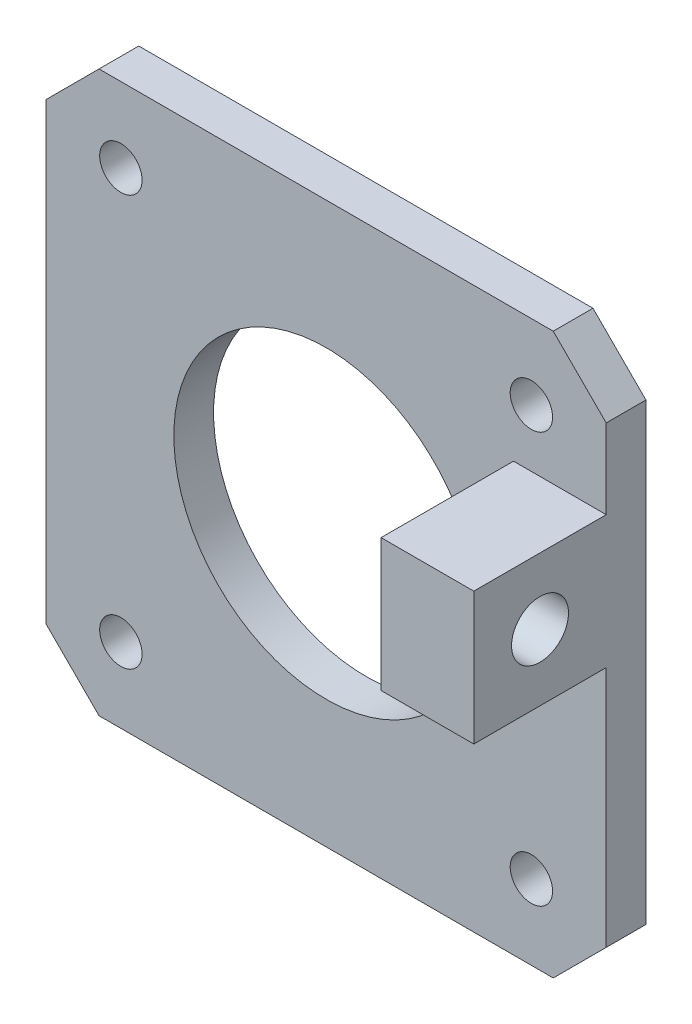
ISO-10303-21;
HEADER;
FILE_DESCRIPTION(('STEP AP214'),'2;1');
FILE_NAME('part.step','',(''),(''),'','','');
FILE_SCHEMA(('AUTOMOTIVE_DESIGN { 1 0 10303 214 1 1 1 1 }'));
ENDSEC;
DATA;
#1=APPLICATION_CONTEXT('core data for automotive mechanical design processes');
#2=APPLICATION_PROTOCOL_DEFINITION('international standard','automotive_design',2000,#1);
#3=PRODUCT_CONTEXT('',#1,'mechanical');
#4=PRODUCT('Part','Part','',(#3));
#5=PRODUCT_RELATED_PRODUCT_CATEGORY('part','',(#4));
#6=PRODUCT_DEFINITION_FORMATION('','',#4);
#7=PRODUCT_DEFINITION_CONTEXT('part definition',#1,'design');
#8=PRODUCT_DEFINITION('design','',#6,#7);
#9=PRODUCT_DEFINITION_SHAPE('','',#8);
#10=(LENGTH_UNIT() NAMED_UNIT(*) SI_UNIT(.MILLI.,.METRE.));
#11=(NAMED_UNIT(*) PLANE_ANGLE_UNIT() SI_UNIT($,.RADIAN.));
#12=(NAMED_UNIT(*) SI_UNIT($,.STERADIAN.) SOLID_ANGLE_UNIT());
#13=UNCERTAINTY_MEASURE_WITH_UNIT(LENGTH_MEASURE(1.E-05),#10,'distance_accuracy_value','');
#14=(GEOMETRIC_REPRESENTATION_CONTEXT(3) GLOBAL_UNCERTAINTY_ASSIGNED_CONTEXT((#13)) GLOBAL_UNIT_ASSIGNED_CONTEXT((#10,
#11,#12)) REPRESENTATION_CONTEXT('',''));
#15=CARTESIAN_POINT('',(0.,0.,0.));
#16=DIRECTION('',(0.,0.,1.));
#17=DIRECTION('',(1.,0.,0.));
#18=AXIS2_PLACEMENT_3D('',#15,#16,#17);
#19=CARTESIAN_POINT('',(0.,0.,3.));
#20=DIRECTION('',(0.,0.,-1.));
#21=DIRECTION('',(-1.,0.,0.));
#22=AXIS2_PLACEMENT_3D('',#19,#20,#21);
#23=PLANE('',#22);
#24=CARTESIAN_POINT('',(15.5,-15.5,3.));
#25=DIRECTION('',(0.,0.,1.));
#26=DIRECTION('',(1.,0.,0.));
#27=AXIS2_PLACEMENT_3D('',#24,#25,#26);
#28=CIRCLE('',#27,1.6);
#29=CARTESIAN_POINT('',(17.1,-15.5,3.));
#30=VERTEX_POINT('',#29);
#31=EDGE_CURVE('E234',#30,#30,#28,.T.);
#32=ORIENTED_EDGE('',*,*,#31,.F.);
#33=EDGE_LOOP('',(#32));
#34=FACE_BOUND('',#33,.T.);
#35=CARTESIAN_POINT('',(-15.5,15.5,3.));
#36=DIRECTION('',(0.,0.,1.));
#37=DIRECTION('',(1.,0.,0.));
#38=AXIS2_PLACEMENT_3D('',#35,#36,#37);
#39=CIRCLE('',#38,1.60000000000001);
#40=CARTESIAN_POINT('',(-13.9,15.5,3.));
#41=VERTEX_POINT('',#40);
#42=EDGE_CURVE('E228',#41,#41,#39,.T.);
#43=ORIENTED_EDGE('',*,*,#42,.F.);
#44=EDGE_LOOP('',(#43));
#45=FACE_BOUND('',#44,.T.);
#46=CARTESIAN_POINT('',(-15.5,-15.5,3.));
#47=DIRECTION('',(0.,0.,1.));
#48=DIRECTION('',(1.,0.,0.));
#49=AXIS2_PLACEMENT_3D('',#46,#47,#48);
#50=CIRCLE('',#49,1.6);
#51=CARTESIAN_POINT('',(-13.9,-15.5,3.));
#52=VERTEX_POINT('',#51);
#53=EDGE_CURVE('E222',#52,#52,#50,.T.);
#54=ORIENTED_EDGE('',*,*,#53,.F.);
#55=EDGE_LOOP('',(#54));
#56=FACE_BOUND('',#55,.T.);
#57=CARTESIAN_POINT('',(15.5,15.5,3.));
#58=DIRECTION('',(0.,0.,1.));
#59=DIRECTION('',(1.,0.,0.));
#60=AXIS2_PLACEMENT_3D('',#57,#58,#59);
#61=CIRCLE('',#60,1.60000000000001);
#62=CARTESIAN_POINT('',(17.1,15.5,3.));
#63=VERTEX_POINT('',#62);
#64=EDGE_CURVE('E216',#63,#63,#61,.T.);
#65=ORIENTED_EDGE('',*,*,#64,.F.);
#66=EDGE_LOOP('',(#65));
#67=FACE_BOUND('',#66,.T.);
#68=CARTESIAN_POINT('',(0.,0.,3.));
#69=DIRECTION('',(0.,0.,1.));
#70=DIRECTION('',(1.,0.,0.));
#71=AXIS2_PLACEMENT_3D('',#68,#69,#70);
#72=CIRCLE('',#71,11.5);
#73=CARTESIAN_POINT('',(11.5,0.,3.));
#74=VERTEX_POINT('',#73);
#75=EDGE_CURVE('E167',#74,#74,#72,.T.);
#76=ORIENTED_EDGE('',*,*,#75,.F.);
#77=EDGE_LOOP('',(#76));
#78=FACE_BOUND('',#77,.T.);
#79=DIRECTION('',(1.,0.,0.));
#80=VECTOR('',#79,1.);
#81=CARTESIAN_POINT('',(14.15,1.15000000011601,3.));
#82=LINE('',#81,#80);
#83=CARTESIAN_POINT('',(14.15,1.15000000011601,3.));
#84=VERTEX_POINT('',#83);
#85=CARTESIAN_POINT('',(21.15,1.15000000011601,3.));
#86=VERTEX_POINT('',#85);
#87=EDGE_CURVE('E246',#84,#86,#82,.T.);
#88=ORIENTED_EDGE('',*,*,#87,.F.);
#89=DIRECTION('',(0.,-1.,0.));
#90=VECTOR('',#89,1.);
#91=CARTESIAN_POINT('',(14.15,0.,3.));
#92=LINE('',#91,#90);
#93=CARTESIAN_POINT('',(14.15,11.150000000116,3.));
#94=VERTEX_POINT('',#93);
#95=EDGE_CURVE('E263',#94,#84,#92,.T.);
#96=ORIENTED_EDGE('',*,*,#95,.F.);
#97=DIRECTION('',(1.,0.,0.));
#98=VECTOR('',#97,1.);
#99=CARTESIAN_POINT('',(14.15,11.150000000116,3.));
#100=LINE('',#99,#98);
#101=CARTESIAN_POINT('',(21.15,11.150000000116,3.));
#102=VERTEX_POINT('',#101);
#103=EDGE_CURVE('E250',#94,#102,#100,.T.);
#104=ORIENTED_EDGE('',*,*,#103,.T.);
#105=DIRECTION('',(0.,1.,0.));
#106=VECTOR('',#105,1.);
#107=CARTESIAN_POINT('',(21.15,17.15,3.));
#108=LINE('',#107,#106);
#109=CARTESIAN_POINT('',(21.15,17.15,3.));
#110=VERTEX_POINT('',#109);
#111=EDGE_CURVE('E140',#102,#110,#108,.T.);
#112=ORIENTED_EDGE('',*,*,#111,.T.);
#113=DIRECTION('',(-0.707106781186548,0.707106781186548,0.));
#114=VECTOR('',#113,1.);
#115=CARTESIAN_POINT('',(21.15,17.15,3.));
#116=LINE('',#115,#114);
#117=CARTESIAN_POINT('',(17.15,21.15,3.));
#118=VERTEX_POINT('',#117);
#119=EDGE_CURVE('E71',#110,#118,#116,.T.);
#120=ORIENTED_EDGE('',*,*,#119,.T.);
#121=DIRECTION('',(-1.,0.,0.));
#122=VECTOR('',#121,1.);
#123=CARTESIAN_POINT('',(-17.15,21.15,3.));
#124=LINE('',#123,#122);
#125=CARTESIAN_POINT('',(-17.15,21.15,3.));
#126=VERTEX_POINT('',#125);
#127=EDGE_CURVE('E179',#118,#126,#124,.T.);
#128=ORIENTED_EDGE('',*,*,#127,.T.);
#129=DIRECTION('',(-0.707106781186548,-0.707106781186548,0.));
#130=VECTOR('',#129,1.);
#131=CARTESIAN_POINT('',(-21.15,17.15,3.));
#132=LINE('',#131,#130);
#133=CARTESIAN_POINT('',(-21.15,17.15,3.));
#134=VERTEX_POINT('',#133);
#135=EDGE_CURVE('E112',#126,#134,#132,.T.);
#136=ORIENTED_EDGE('',*,*,#135,.T.);
#137=DIRECTION('',(0.,-1.,0.));
#138=VECTOR('',#137,1.);
#139=CARTESIAN_POINT('',(-21.15,-17.15,3.));
#140=LINE('',#139,#138);
#141=CARTESIAN_POINT('',(-21.15,-17.15,3.));
#142=VERTEX_POINT('',#141);
#143=EDGE_CURVE('E194',#134,#142,#140,.T.);
#144=ORIENTED_EDGE('',*,*,#143,.T.);
#145=DIRECTION('',(0.707106781186548,-0.707106781186548,0.));
#146=VECTOR('',#145,1.);
#147=CARTESIAN_POINT('',(-17.15,-21.15,3.));
#148=LINE('',#147,#146);
#149=CARTESIAN_POINT('',(-17.15,-21.15,3.));
#150=VERTEX_POINT('',#149);
#151=EDGE_CURVE('E207',#142,#150,#148,.T.);
#152=ORIENTED_EDGE('',*,*,#151,.T.);
#153=DIRECTION('',(1.,0.,0.));
#154=VECTOR('',#153,1.);
#155=CARTESIAN_POINT('',(17.15,-21.15,3.));
#156=LINE('',#155,#154);
#157=CARTESIAN_POINT('',(17.15,-21.15,3.));
#158=VERTEX_POINT('',#157);
#159=EDGE_CURVE('E136',#150,#158,#156,.T.);
#160=ORIENTED_EDGE('',*,*,#159,.T.);
#161=DIRECTION('',(0.707106781186548,0.707106781186548,0.));
#162=VECTOR('',#161,1.);
#163=CARTESIAN_POINT('',(21.15,-17.15,3.));
#164=LINE('',#163,#162);
#165=CARTESIAN_POINT('',(21.15,-17.15,3.));
#166=VERTEX_POINT('',#165);
#167=EDGE_CURVE('E129',#158,#166,#164,.T.);
#168=ORIENTED_EDGE('',*,*,#167,.T.);
#169=EDGE_CURVE('E134',#166,#86,#108,.T.);
#170=ORIENTED_EDGE('',*,*,#169,.T.);
#171=EDGE_LOOP('',(#88,#96,#104,#112,#120,#128,#136,#144,#152,#160,#168,#170));
#172=FACE_BOUND('',#171,.T.);
#173=ADVANCED_FACE('F47',(#34,#45,#56,#67,#78,#172),#23,.F.);
#174=CARTESIAN_POINT('',(0.,0.,0.));
#175=DIRECTION('',(0.,0.,-1.));
#176=DIRECTION('',(-1.,0.,0.));
#177=AXIS2_PLACEMENT_3D('',#174,#175,#176);
#178=PLANE('',#177);
#179=CARTESIAN_POINT('',(-15.5,15.5,0.));
#180=DIRECTION('',(0.,0.,1.));
#181=DIRECTION('',(1.,0.,0.));
#182=AXIS2_PLACEMENT_3D('',#179,#180,#181);
#183=CIRCLE('',#182,1.60000000000001);
#184=CARTESIAN_POINT('',(-13.9,15.5,0.));
#185=VERTEX_POINT('',#184);
#186=EDGE_CURVE('E231',#185,#185,#183,.T.);
#187=ORIENTED_EDGE('',*,*,#186,.T.);
#188=EDGE_LOOP('',(#187));
#189=FACE_BOUND('',#188,.T.);
#190=CARTESIAN_POINT('',(15.5,15.5,0.));
#191=DIRECTION('',(0.,0.,1.));
#192=DIRECTION('',(1.,0.,0.));
#193=AXIS2_PLACEMENT_3D('',#190,#191,#192);
#194=CIRCLE('',#193,1.60000000000001);
#195=CARTESIAN_POINT('',(17.1,15.5,0.));
#196=VERTEX_POINT('',#195);
#197=EDGE_CURVE('E219',#196,#196,#194,.T.);
#198=ORIENTED_EDGE('',*,*,#197,.T.);
#199=EDGE_LOOP('',(#198));
#200=FACE_BOUND('',#199,.T.);
#201=DIRECTION('',(-1.,0.,0.));
#202=VECTOR('',#201,1.);
#203=CARTESIAN_POINT('',(-17.15,21.15,0.));
#204=LINE('',#203,#202);
#205=CARTESIAN_POINT('',(17.15,21.15,0.));
#206=VERTEX_POINT('',#205);
#207=CARTESIAN_POINT('',(-17.15,21.15,0.));
#208=VERTEX_POINT('',#207);
#209=EDGE_CURVE('E163',#206,#208,#204,.T.);
#210=ORIENTED_EDGE('',*,*,#209,.F.);
#211=DIRECTION('',(-0.707106781186548,0.707106781186548,0.));
#212=VECTOR('',#211,1.);
#213=CARTESIAN_POINT('',(21.15,17.15,0.));
#214=LINE('',#213,#212);
#215=CARTESIAN_POINT('',(21.15,17.15,0.));
#216=VERTEX_POINT('',#215);
#217=EDGE_CURVE('E104',#216,#206,#214,.T.);
#218=ORIENTED_EDGE('',*,*,#217,.F.);
#219=DIRECTION('',(0.,1.,0.));
#220=VECTOR('',#219,1.);
#221=CARTESIAN_POINT('',(21.15,17.15,0.));
#222=LINE('',#221,#220);
#223=CARTESIAN_POINT('',(21.15,-17.15,0.));
#224=VERTEX_POINT('',#223);
#225=EDGE_CURVE('E176',#224,#216,#222,.T.);
#226=ORIENTED_EDGE('',*,*,#225,.F.);
#227=DIRECTION('',(0.707106781186548,0.707106781186548,0.));
#228=VECTOR('',#227,1.);
#229=CARTESIAN_POINT('',(21.15,-17.15,0.));
#230=LINE('',#229,#228);
#231=CARTESIAN_POINT('',(17.15,-21.15,0.));
#232=VERTEX_POINT('',#231);
#233=EDGE_CURVE('E146',#232,#224,#230,.T.);
#234=ORIENTED_EDGE('',*,*,#233,.F.);
#235=DIRECTION('',(1.,0.,0.));
#236=VECTOR('',#235,1.);
#237=CARTESIAN_POINT('',(17.15,-21.15,0.));
#238=LINE('',#237,#236);
#239=CARTESIAN_POINT('',(-17.15,-21.15,0.));
#240=VERTEX_POINT('',#239);
#241=EDGE_CURVE('E173',#240,#232,#238,.T.);
#242=ORIENTED_EDGE('',*,*,#241,.F.);
#243=DIRECTION('',(0.707106781186548,-0.707106781186548,0.));
#244=VECTOR('',#243,1.);
#245=CARTESIAN_POINT('',(-17.15,-21.15,0.));
#246=LINE('',#245,#244);
#247=CARTESIAN_POINT('',(-21.15,-17.15,0.));
#248=VERTEX_POINT('',#247);
#249=EDGE_CURVE('E171',#248,#240,#246,.T.);
#250=ORIENTED_EDGE('',*,*,#249,.F.);
#251=DIRECTION('',(0.,-1.,0.));
#252=VECTOR('',#251,1.);
#253=CARTESIAN_POINT('',(-21.15,-17.15,0.));
#254=LINE('',#253,#252);
#255=CARTESIAN_POINT('',(-21.15,17.15,0.));
#256=VERTEX_POINT('',#255);
#257=EDGE_CURVE('E169',#256,#248,#254,.T.);
#258=ORIENTED_EDGE('',*,*,#257,.F.);
#259=DIRECTION('',(-0.707106781186548,-0.707106781186548,0.));
#260=VECTOR('',#259,1.);
#261=CARTESIAN_POINT('',(-21.15,17.15,0.));
#262=LINE('',#261,#260);
#263=EDGE_CURVE('E166',#208,#256,#262,.T.);
#264=ORIENTED_EDGE('',*,*,#263,.F.);
#265=EDGE_LOOP('',(#210,#218,#226,#234,#242,#250,#258,#264));
#266=FACE_BOUND('',#265,.T.);
#267=CARTESIAN_POINT('',(0.,0.,0.));
#268=DIRECTION('',(0.,0.,1.));
#269=DIRECTION('',(1.,0.,0.));
#270=AXIS2_PLACEMENT_3D('',#267,#268,#269);
#271=CIRCLE('',#270,11.5);
#272=CARTESIAN_POINT('',(11.5,0.,0.));
#273=VERTEX_POINT('',#272);
#274=EDGE_CURVE('E213',#273,#273,#271,.T.);
#275=ORIENTED_EDGE('',*,*,#274,.T.);
#276=EDGE_LOOP('',(#275));
#277=FACE_BOUND('',#276,.T.);
#278=CARTESIAN_POINT('',(-15.5,-15.5,0.));
#279=DIRECTION('',(0.,0.,1.));
#280=DIRECTION('',(1.,0.,0.));
#281=AXIS2_PLACEMENT_3D('',#278,#279,#280);
#282=CIRCLE('',#281,1.6);
#283=CARTESIAN_POINT('',(-13.9,-15.5,0.));
#284=VERTEX_POINT('',#283);
#285=EDGE_CURVE('E225',#284,#284,#282,.T.);
#286=ORIENTED_EDGE('',*,*,#285,.T.);
#287=EDGE_LOOP('',(#286));
#288=FACE_BOUND('',#287,.T.);
#289=CARTESIAN_POINT('',(15.5,-15.5,0.));
#290=DIRECTION('',(0.,0.,1.));
#291=DIRECTION('',(1.,0.,0.));
#292=AXIS2_PLACEMENT_3D('',#289,#290,#291);
#293=CIRCLE('',#292,1.6);
#294=CARTESIAN_POINT('',(17.1,-15.5,0.));
#295=VERTEX_POINT('',#294);
#296=EDGE_CURVE('E237',#295,#295,#293,.T.);
#297=ORIENTED_EDGE('',*,*,#296,.T.);
#298=EDGE_LOOP('',(#297));
#299=FACE_BOUND('',#298,.T.);
#300=ADVANCED_FACE('F198',(#189,#200,#266,#277,#288,#299),#178,.T.);
#301=CARTESIAN_POINT('',(-17.15,21.15,3.));
#302=DIRECTION('',(0.,-1.,0.));
#303=DIRECTION('',(0.,0.,-1.));
#304=AXIS2_PLACEMENT_3D('',#301,#302,#303);
#305=PLANE('',#304);
#306=ORIENTED_EDGE('',*,*,#209,.T.);
#307=DIRECTION('',(0.,0.,-1.));
#308=VECTOR('',#307,1.);
#309=CARTESIAN_POINT('',(-17.15,21.15,3.));
#310=LINE('',#309,#308);
#311=EDGE_CURVE('E13',#126,#208,#310,.T.);
#312=ORIENTED_EDGE('',*,*,#311,.F.);
#313=ORIENTED_EDGE('',*,*,#127,.F.);
#314=DIRECTION('',(0.,0.,-1.));
#315=VECTOR('',#314,1.);
#316=CARTESIAN_POINT('',(17.15,21.15,3.));
#317=LINE('',#316,#315);
#318=EDGE_CURVE('E159',#118,#206,#317,.T.);
#319=ORIENTED_EDGE('',*,*,#318,.T.);
#320=EDGE_LOOP('',(#306,#312,#313,#319));
#321=FACE_BOUND('',#320,.T.);
#322=ADVANCED_FACE('F49',(#321),#305,.F.);
#323=CARTESIAN_POINT('',(-21.15,17.15,3.));
#324=DIRECTION('',(0.707106781186547,-0.707106781186547,0.));
#325=DIRECTION('',(0.707106781186548,0.707106781186548,0.));
#326=AXIS2_PLACEMENT_3D('',#323,#324,#325);
#327=PLANE('',#326);
#328=ORIENTED_EDGE('',*,*,#263,.T.);
#329=DIRECTION('',(0.,0.,-1.));
#330=VECTOR('',#329,1.);
#331=CARTESIAN_POINT('',(-21.15,17.15,3.));
#332=LINE('',#331,#330);
#333=EDGE_CURVE('E55',#134,#256,#332,.T.);
#334=ORIENTED_EDGE('',*,*,#333,.F.);
#335=ORIENTED_EDGE('',*,*,#135,.F.);
#336=ORIENTED_EDGE('',*,*,#311,.T.);
#337=EDGE_LOOP('',(#328,#334,#335,#336));
#338=FACE_BOUND('',#337,.T.);
#339=ADVANCED_FACE('F409',(#338),#327,.F.);
#340=CARTESIAN_POINT('',(-21.15,-17.15,3.));
#341=DIRECTION('',(1.,0.,0.));
#342=DIRECTION('',(0.,0.,-1.));
#343=AXIS2_PLACEMENT_3D('',#340,#341,#342);
#344=PLANE('',#343);
#345=ORIENTED_EDGE('',*,*,#257,.T.);
#346=DIRECTION('',(0.,0.,-1.));
#347=VECTOR('',#346,1.);
#348=CARTESIAN_POINT('',(-21.15,-17.15,3.));
#349=LINE('',#348,#347);
#350=EDGE_CURVE('E186',#142,#248,#349,.T.);
#351=ORIENTED_EDGE('',*,*,#350,.F.);
#352=ORIENTED_EDGE('',*,*,#143,.F.);
#353=ORIENTED_EDGE('',*,*,#333,.T.);
#354=EDGE_LOOP('',(#345,#351,#352,#353));
#355=FACE_BOUND('',#354,.T.);
#356=ADVANCED_FACE('F192',(#355),#344,.F.);
#357=CARTESIAN_POINT('',(-17.15,-21.15,3.));
#358=DIRECTION('',(0.707106781186547,0.707106781186547,0.));
#359=DIRECTION('',(-0.707106781186548,0.707106781186548,0.));
#360=AXIS2_PLACEMENT_3D('',#357,#358,#359);
#361=PLANE('',#360);
#362=ORIENTED_EDGE('',*,*,#249,.T.);
#363=DIRECTION('',(0.,0.,-1.));
#364=VECTOR('',#363,1.);
#365=CARTESIAN_POINT('',(-17.15,-21.15,3.));
#366=LINE('',#365,#364);
#367=EDGE_CURVE('E183',#150,#240,#366,.T.);
#368=ORIENTED_EDGE('',*,*,#367,.F.);
#369=ORIENTED_EDGE('',*,*,#151,.F.);
#370=ORIENTED_EDGE('',*,*,#350,.T.);
#371=EDGE_LOOP('',(#362,#368,#369,#370));
#372=FACE_BOUND('',#371,.T.);
#373=ADVANCED_FACE('F203',(#372),#361,.F.);
#374=CARTESIAN_POINT('',(17.15,-21.15,3.));
#375=DIRECTION('',(0.,1.,0.));
#376=DIRECTION('',(0.,0.,1.));
#377=AXIS2_PLACEMENT_3D('',#374,#375,#376);
#378=PLANE('',#377);
#379=ORIENTED_EDGE('',*,*,#241,.T.);
#380=DIRECTION('',(0.,0.,-1.));
#381=VECTOR('',#380,1.);
#382=CARTESIAN_POINT('',(17.15,-21.15,3.));
#383=LINE('',#382,#381);
#384=EDGE_CURVE('E149',#158,#232,#383,.T.);
#385=ORIENTED_EDGE('',*,*,#384,.F.);
#386=ORIENTED_EDGE('',*,*,#159,.F.);
#387=ORIENTED_EDGE('',*,*,#367,.T.);
#388=EDGE_LOOP('',(#379,#385,#386,#387));
#389=FACE_BOUND('',#388,.T.);
#390=ADVANCED_FACE('F206',(#389),#378,.F.);
#391=CARTESIAN_POINT('',(21.15,-17.15,3.));
#392=DIRECTION('',(-0.707106781186547,0.707106781186547,0.));
#393=DIRECTION('',(-0.707106781186548,-0.707106781186548,0.));
#394=AXIS2_PLACEMENT_3D('',#391,#392,#393);
#395=PLANE('',#394);
#396=ORIENTED_EDGE('',*,*,#233,.T.);
#397=DIRECTION('',(0.,0.,-1.));
#398=VECTOR('',#397,1.);
#399=CARTESIAN_POINT('',(21.15,-17.15,3.));
#400=LINE('',#399,#398);
#401=EDGE_CURVE('E143',#166,#224,#400,.T.);
#402=ORIENTED_EDGE('',*,*,#401,.F.);
#403=ORIENTED_EDGE('',*,*,#167,.F.);
#404=ORIENTED_EDGE('',*,*,#384,.T.);
#405=EDGE_LOOP('',(#396,#402,#403,#404));
#406=FACE_BOUND('',#405,.T.);
#407=ADVANCED_FACE('F144',(#406),#395,.F.);
#408=CARTESIAN_POINT('',(21.15,17.15,3.));
#409=DIRECTION('',(-1.,0.,0.));
#410=DIRECTION('',(0.,0.,1.));
#411=AXIS2_PLACEMENT_3D('',#408,#409,#410);
#412=PLANE('',#411);
#413=ORIENTED_EDGE('',*,*,#225,.T.);
#414=DIRECTION('',(0.,0.,-1.));
#415=VECTOR('',#414,1.);
#416=CARTESIAN_POINT('',(21.15,17.15,3.));
#417=LINE('',#416,#415);
#418=EDGE_CURVE('E150',#110,#216,#417,.T.);
#419=ORIENTED_EDGE('',*,*,#418,.F.);
#420=ORIENTED_EDGE('',*,*,#111,.F.);
#421=DIRECTION('',(0.,0.,-1.));
#422=VECTOR('',#421,1.);
#423=CARTESIAN_POINT('',(21.15,11.150000000116,0.));
#424=LINE('',#423,#422);
#425=CARTESIAN_POINT('',(21.15,11.150000000116,13.));
#426=VERTEX_POINT('',#425);
#427=EDGE_CURVE('E62',#426,#102,#424,.T.);
#428=ORIENTED_EDGE('',*,*,#427,.F.);
#429=DIRECTION('',(0.,-1.,0.));
#430=VECTOR('',#429,1.);
#431=CARTESIAN_POINT('',(21.15,0.,13.));
#432=LINE('',#431,#430);
#433=CARTESIAN_POINT('',(21.15,1.15000000011601,13.));
#434=VERTEX_POINT('',#433);
#435=EDGE_CURVE('E256',#426,#434,#432,.T.);
#436=ORIENTED_EDGE('',*,*,#435,.T.);
#437=DIRECTION('',(0.,0.,-1.));
#438=VECTOR('',#437,1.);
#439=CARTESIAN_POINT('',(21.15,1.15000000011601,0.));
#440=LINE('',#439,#438);
#441=EDGE_CURVE('E157',#434,#86,#440,.T.);
#442=ORIENTED_EDGE('',*,*,#441,.T.);
#443=ORIENTED_EDGE('',*,*,#169,.F.);
#444=ORIENTED_EDGE('',*,*,#401,.T.);
#445=EDGE_LOOP('',(#413,#419,#420,#428,#436,#442,#443,#444));
#446=FACE_BOUND('',#445,.T.);
#447=CARTESIAN_POINT('',(21.15,6.15000000011601,7.99999999999998));
#448=DIRECTION('',(1.,0.,0.));
#449=DIRECTION('',(0.,0.,-1.));
#450=AXIS2_PLACEMENT_3D('',#447,#448,#449);
#451=CIRCLE('',#450,2.14999999999996);
#452=CARTESIAN_POINT('',(21.15,6.15000000011601,5.85000000000002));
#453=VERTEX_POINT('',#452);
#454=EDGE_CURVE('E258',#453,#453,#451,.T.);
#455=ORIENTED_EDGE('',*,*,#454,.F.);
#456=EDGE_LOOP('',(#455));
#457=FACE_BOUND('',#456,.T.);
#458=ADVANCED_FACE('F153',(#446,#457),#412,.F.);
#459=CARTESIAN_POINT('',(21.15,17.15,3.));
#460=DIRECTION('',(-0.707106781186547,-0.707106781186547,0.));
#461=DIRECTION('',(0.707106781186548,-0.707106781186548,0.));
#462=AXIS2_PLACEMENT_3D('',#459,#460,#461);
#463=PLANE('',#462);
#464=ORIENTED_EDGE('',*,*,#217,.T.);
#465=ORIENTED_EDGE('',*,*,#318,.F.);
#466=ORIENTED_EDGE('',*,*,#119,.F.);
#467=ORIENTED_EDGE('',*,*,#418,.T.);
#468=EDGE_LOOP('',(#464,#465,#466,#467));
#469=FACE_BOUND('',#468,.T.);
#470=ADVANCED_FACE('F286',(#469),#463,.F.);
#471=CARTESIAN_POINT('',(0.,0.,3.));
#472=DIRECTION('',(0.,0.,-1.));
#473=DIRECTION('',(-1.,0.,0.));
#474=AXIS2_PLACEMENT_3D('',#471,#472,#473);
#475=CYLINDRICAL_SURFACE('',#474,11.5);
#476=ORIENTED_EDGE('',*,*,#75,.T.);
#477=EDGE_LOOP('',(#476));
#478=FACE_BOUND('',#477,.T.);
#479=ORIENTED_EDGE('',*,*,#274,.F.);
#480=EDGE_LOOP('',(#479));
#481=FACE_BOUND('',#480,.T.);
#482=ADVANCED_FACE('F292',(#478,#481),#475,.F.);
#483=CARTESIAN_POINT('',(15.5,15.5,3.));
#484=DIRECTION('',(0.,0.,-1.));
#485=DIRECTION('',(-1.,0.,0.));
#486=AXIS2_PLACEMENT_3D('',#483,#484,#485);
#487=CYLINDRICAL_SURFACE('',#486,1.60000000000001);
#488=ORIENTED_EDGE('',*,*,#64,.T.);
#489=EDGE_LOOP('',(#488));
#490=FACE_BOUND('',#489,.T.);
#491=ORIENTED_EDGE('',*,*,#197,.F.);
#492=EDGE_LOOP('',(#491));
#493=FACE_BOUND('',#492,.T.);
#494=ADVANCED_FACE('F308',(#490,#493),#487,.F.);
#495=CARTESIAN_POINT('',(-15.5,-15.5,3.));
#496=DIRECTION('',(0.,0.,-1.));
#497=DIRECTION('',(-1.,0.,0.));
#498=AXIS2_PLACEMENT_3D('',#495,#496,#497);
#499=CYLINDRICAL_SURFACE('',#498,1.6);
#500=ORIENTED_EDGE('',*,*,#53,.T.);
#501=EDGE_LOOP('',(#500));
#502=FACE_BOUND('',#501,.T.);
#503=ORIENTED_EDGE('',*,*,#285,.F.);
#504=EDGE_LOOP('',(#503));
#505=FACE_BOUND('',#504,.T.);
#506=ADVANCED_FACE('F312',(#502,#505),#499,.F.);
#507=CARTESIAN_POINT('',(-15.5,15.5,3.));
#508=DIRECTION('',(0.,0.,-1.));
#509=DIRECTION('',(-1.,0.,0.));
#510=AXIS2_PLACEMENT_3D('',#507,#508,#509);
#511=CYLINDRICAL_SURFACE('',#510,1.60000000000001);
#512=ORIENTED_EDGE('',*,*,#42,.T.);
#513=EDGE_LOOP('',(#512));
#514=FACE_BOUND('',#513,.T.);
#515=ORIENTED_EDGE('',*,*,#186,.F.);
#516=EDGE_LOOP('',(#515));
#517=FACE_BOUND('',#516,.T.);
#518=ADVANCED_FACE('F316',(#514,#517),#511,.F.);
#519=CARTESIAN_POINT('',(15.5,-15.5,3.));
#520=DIRECTION('',(0.,0.,-1.));
#521=DIRECTION('',(-1.,0.,0.));
#522=AXIS2_PLACEMENT_3D('',#519,#520,#521);
#523=CYLINDRICAL_SURFACE('',#522,1.6);
#524=ORIENTED_EDGE('',*,*,#31,.T.);
#525=EDGE_LOOP('',(#524));
#526=FACE_BOUND('',#525,.T.);
#527=ORIENTED_EDGE('',*,*,#296,.F.);
#528=EDGE_LOOP('',(#527));
#529=FACE_BOUND('',#528,.T.);
#530=ADVANCED_FACE('F320',(#526,#529),#523,.F.);
#531=CARTESIAN_POINT('',(14.15,0.,13.));
#532=DIRECTION('',(0.,0.,1.));
#533=DIRECTION('',(1.,0.,0.));
#534=AXIS2_PLACEMENT_3D('',#531,#532,#533);
#535=PLANE('',#534);
#536=ORIENTED_EDGE('',*,*,#435,.F.);
#537=DIRECTION('',(1.,0.,0.));
#538=VECTOR('',#537,1.);
#539=CARTESIAN_POINT('',(14.15,11.150000000116,13.));
#540=LINE('',#539,#538);
#541=CARTESIAN_POINT('',(14.15,11.150000000116,13.));
#542=VERTEX_POINT('',#541);
#543=EDGE_CURVE('E240',#542,#426,#540,.T.);
#544=ORIENTED_EDGE('',*,*,#543,.F.);
#545=DIRECTION('',(0.,-1.,0.));
#546=VECTOR('',#545,1.);
#547=CARTESIAN_POINT('',(14.15,0.,13.));
#548=LINE('',#547,#546);
#549=CARTESIAN_POINT('',(14.15,1.15000000011601,13.));
#550=VERTEX_POINT('',#549);
#551=EDGE_CURVE('E269',#542,#550,#548,.T.);
#552=ORIENTED_EDGE('',*,*,#551,.T.);
#553=DIRECTION('',(1.,0.,0.));
#554=VECTOR('',#553,1.);
#555=CARTESIAN_POINT('',(14.15,1.15000000011601,13.));
#556=LINE('',#555,#554);
#557=EDGE_CURVE('E243',#550,#434,#556,.T.);
#558=ORIENTED_EDGE('',*,*,#557,.T.);
#559=EDGE_LOOP('',(#536,#544,#552,#558));
#560=FACE_BOUND('',#559,.T.);
#561=ADVANCED_FACE('F323',(#560),#535,.T.);
#562=CARTESIAN_POINT('',(14.15,11.150000000116,0.));
#563=DIRECTION('',(0.,-1.,0.));
#564=DIRECTION('',(0.,0.,-1.));
#565=AXIS2_PLACEMENT_3D('',#562,#563,#564);
#566=PLANE('',#565);
#567=ORIENTED_EDGE('',*,*,#427,.T.);
#568=ORIENTED_EDGE('',*,*,#103,.F.);
#569=DIRECTION('',(0.,0.,-1.));
#570=VECTOR('',#569,1.);
#571=CARTESIAN_POINT('',(14.15,11.150000000116,0.));
#572=LINE('',#571,#570);
#573=EDGE_CURVE('E247',#542,#94,#572,.T.);
#574=ORIENTED_EDGE('',*,*,#573,.F.);
#575=ORIENTED_EDGE('',*,*,#543,.T.);
#576=EDGE_LOOP('',(#567,#568,#574,#575));
#577=FACE_BOUND('',#576,.T.);
#578=ADVANCED_FACE('F282',(#577),#566,.F.);
#579=CARTESIAN_POINT('',(14.15,6.15000000011601,7.99999999999998));
#580=DIRECTION('',(1.,0.,0.));
#581=DIRECTION('',(0.,0.,-1.));
#582=AXIS2_PLACEMENT_3D('',#579,#580,#581);
#583=CYLINDRICAL_SURFACE('',#582,2.14999999999996);
#584=CARTESIAN_POINT('',(14.15,6.15000000011601,7.99999999999998));
#585=DIRECTION('',(1.,0.,0.));
#586=DIRECTION('',(0.,0.,-1.));
#587=AXIS2_PLACEMENT_3D('',#584,#585,#586);
#588=CIRCLE('',#587,2.14999999999996);
#589=CARTESIAN_POINT('',(14.15,6.15000000011601,5.85000000000002));
#590=VERTEX_POINT('',#589);
#591=EDGE_CURVE('E254',#590,#590,#588,.T.);
#592=ORIENTED_EDGE('',*,*,#591,.F.);
#593=EDGE_LOOP('',(#592));
#594=FACE_BOUND('',#593,.T.);
#595=ORIENTED_EDGE('',*,*,#454,.T.);
#596=EDGE_LOOP('',(#595));
#597=FACE_BOUND('',#596,.T.);
#598=ADVANCED_FACE('F278',(#594,#597),#583,.F.);
#599=CARTESIAN_POINT('',(14.15,1.15000000011601,0.));
#600=DIRECTION('',(0.,-1.,0.));
#601=DIRECTION('',(0.,0.,-1.));
#602=AXIS2_PLACEMENT_3D('',#599,#600,#601);
#603=PLANE('',#602);
#604=ORIENTED_EDGE('',*,*,#441,.F.);
#605=ORIENTED_EDGE('',*,*,#557,.F.);
#606=DIRECTION('',(0.,0.,-1.));
#607=VECTOR('',#606,1.);
#608=CARTESIAN_POINT('',(14.15,1.15000000011601,0.));
#609=LINE('',#608,#607);
#610=EDGE_CURVE('E266',#550,#84,#609,.T.);
#611=ORIENTED_EDGE('',*,*,#610,.T.);
#612=ORIENTED_EDGE('',*,*,#87,.T.);
#613=EDGE_LOOP('',(#604,#605,#611,#612));
#614=FACE_BOUND('',#613,.T.);
#615=ADVANCED_FACE('F281',(#614),#603,.T.);
#616=CARTESIAN_POINT('',(14.15,0.,0.));
#617=DIRECTION('',(1.,0.,0.));
#618=DIRECTION('',(0.,0.,-1.));
#619=AXIS2_PLACEMENT_3D('',#616,#617,#618);
#620=PLANE('',#619);
#621=ORIENTED_EDGE('',*,*,#591,.T.);
#622=EDGE_LOOP('',(#621));
#623=FACE_BOUND('',#622,.T.);
#624=ORIENTED_EDGE('',*,*,#551,.F.);
#625=ORIENTED_EDGE('',*,*,#573,.T.);
#626=ORIENTED_EDGE('',*,*,#95,.T.);
#627=ORIENTED_EDGE('',*,*,#610,.F.);
#628=EDGE_LOOP('',(#624,#625,#626,#627));
#629=FACE_BOUND('',#628,.T.);
#630=ADVANCED_FACE('F275',(#623,#629),#620,.F.);
#631=CLOSED_SHELL('',(#173,#300,#322,#339,#356,#373,#390,#407,#458,#470,#482,#494,#506,#518,
#530,#561,#578,#598,#615,#630));
#632=MANIFOLD_SOLID_BREP('B2',#631);
#633=ADVANCED_BREP_SHAPE_REPRESENTATION('',(#18,#632),#14);
#634=SHAPE_DEFINITION_REPRESENTATION(#9,#633);
ENDSEC;
END-ISO-10303-21;
